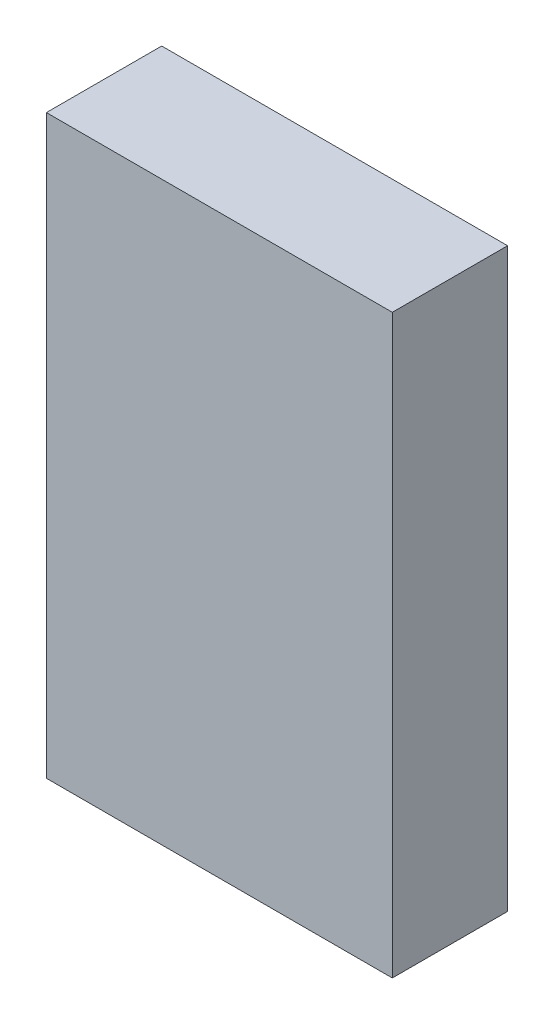
ISO-10303-21;
HEADER;
FILE_DESCRIPTION(('STEP AP214'),'2;1');
FILE_NAME('part.step','',(''),(''),'','','');
FILE_SCHEMA(('AUTOMOTIVE_DESIGN { 1 0 10303 214 1 1 1 1 }'));
ENDSEC;
DATA;
#1=APPLICATION_CONTEXT('core data for automotive mechanical design processes');
#2=APPLICATION_PROTOCOL_DEFINITION('international standard','automotive_design',2000,#1);
#3=PRODUCT_CONTEXT('',#1,'mechanical');
#4=PRODUCT('Part','Part','',(#3));
#5=PRODUCT_RELATED_PRODUCT_CATEGORY('part','',(#4));
#6=PRODUCT_DEFINITION_FORMATION('','',#4);
#7=PRODUCT_DEFINITION_CONTEXT('part definition',#1,'design');
#8=PRODUCT_DEFINITION('design','',#6,#7);
#9=PRODUCT_DEFINITION_SHAPE('','',#8);
#10=(LENGTH_UNIT() NAMED_UNIT(*) SI_UNIT(.MILLI.,.METRE.));
#11=(NAMED_UNIT(*) PLANE_ANGLE_UNIT() SI_UNIT($,.RADIAN.));
#12=(NAMED_UNIT(*) SI_UNIT($,.STERADIAN.) SOLID_ANGLE_UNIT());
#13=UNCERTAINTY_MEASURE_WITH_UNIT(LENGTH_MEASURE(1.E-05),#10,'distance_accuracy_value','');
#14=(GEOMETRIC_REPRESENTATION_CONTEXT(3) GLOBAL_UNCERTAINTY_ASSIGNED_CONTEXT((#13)) GLOBAL_UNIT_ASSIGNED_CONTEXT((#10,
#11,#12)) REPRESENTATION_CONTEXT('',''));
#15=CARTESIAN_POINT('',(0.,0.,0.));
#16=DIRECTION('',(0.,0.,1.));
#17=DIRECTION('',(1.,0.,0.));
#18=AXIS2_PLACEMENT_3D('',#15,#16,#17);
#19=CARTESIAN_POINT('',(-1.5,2.5,0.));
#20=DIRECTION('',(0.,1.,0.));
#21=DIRECTION('',(1.,0.,0.));
#22=AXIS2_PLACEMENT_3D('',#19,#20,#21);
#23=PLANE('',#22);
#24=DIRECTION('',(0.,0.,1.));
#25=VECTOR('',#24,1.);
#26=CARTESIAN_POINT('',(-1.5,2.5,0.));
#27=LINE('',#26,#25);
#28=CARTESIAN_POINT('',(-1.5,2.5,0.));
#29=VERTEX_POINT('',#28);
#30=CARTESIAN_POINT('',(-1.5,2.5,1.));
#31=VERTEX_POINT('',#30);
#32=EDGE_CURVE('E11',#29,#31,#27,.T.);
#33=ORIENTED_EDGE('',*,*,#32,.T.);
#34=DIRECTION('',(1.,0.,0.));
#35=VECTOR('',#34,1.);
#36=CARTESIAN_POINT('',(-1.5,2.5,1.));
#37=LINE('',#36,#35);
#38=CARTESIAN_POINT('',(1.5,2.5,1.));
#39=VERTEX_POINT('',#38);
#40=EDGE_CURVE('E24',#31,#39,#37,.T.);
#41=ORIENTED_EDGE('',*,*,#40,.T.);
#42=DIRECTION('',(0.,0.,1.));
#43=VECTOR('',#42,1.);
#44=CARTESIAN_POINT('',(1.5,2.5,0.));
#45=LINE('',#44,#43);
#46=CARTESIAN_POINT('',(1.5,2.5,0.));
#47=VERTEX_POINT('',#46);
#48=EDGE_CURVE('E85',#47,#39,#45,.T.);
#49=ORIENTED_EDGE('',*,*,#48,.F.);
#50=DIRECTION('',(1.,0.,0.));
#51=VECTOR('',#50,1.);
#52=CARTESIAN_POINT('',(-1.5,2.5,0.));
#53=LINE('',#52,#51);
#54=EDGE_CURVE('E83',#29,#47,#53,.T.);
#55=ORIENTED_EDGE('',*,*,#54,.F.);
#56=EDGE_LOOP('',(#33,#41,#49,#55));
#57=FACE_BOUND('',#56,.T.);
#58=ADVANCED_FACE('F17',(#57),#23,.T.);
#59=CARTESIAN_POINT('',(1.5,2.5,0.));
#60=DIRECTION('',(1.,0.,0.));
#61=DIRECTION('',(0.,-1.,0.));
#62=AXIS2_PLACEMENT_3D('',#59,#60,#61);
#63=PLANE('',#62);
#64=ORIENTED_EDGE('',*,*,#48,.T.);
#65=DIRECTION('',(0.,-1.,0.));
#66=VECTOR('',#65,1.);
#67=CARTESIAN_POINT('',(1.5,2.5,1.));
#68=LINE('',#67,#66);
#69=CARTESIAN_POINT('',(1.5,-2.5,1.));
#70=VERTEX_POINT('',#69);
#71=EDGE_CURVE('E81',#39,#70,#68,.T.);
#72=ORIENTED_EDGE('',*,*,#71,.T.);
#73=DIRECTION('',(0.,0.,1.));
#74=VECTOR('',#73,1.);
#75=CARTESIAN_POINT('',(1.5,-2.5,0.));
#76=LINE('',#75,#74);
#77=CARTESIAN_POINT('',(1.5,-2.5,0.));
#78=VERTEX_POINT('',#77);
#79=EDGE_CURVE('E79',#78,#70,#76,.T.);
#80=ORIENTED_EDGE('',*,*,#79,.F.);
#81=DIRECTION('',(0.,-1.,0.));
#82=VECTOR('',#81,1.);
#83=CARTESIAN_POINT('',(1.5,2.5,0.));
#84=LINE('',#83,#82);
#85=EDGE_CURVE('E70',#47,#78,#84,.T.);
#86=ORIENTED_EDGE('',*,*,#85,.F.);
#87=EDGE_LOOP('',(#64,#72,#80,#86));
#88=FACE_BOUND('',#87,.T.);
#89=ADVANCED_FACE('F90',(#88),#63,.T.);
#90=CARTESIAN_POINT('',(1.5,-2.5,0.));
#91=DIRECTION('',(0.,-1.,0.));
#92=DIRECTION('',(-1.,0.,0.));
#93=AXIS2_PLACEMENT_3D('',#90,#91,#92);
#94=PLANE('',#93);
#95=ORIENTED_EDGE('',*,*,#79,.T.);
#96=DIRECTION('',(-1.,0.,0.));
#97=VECTOR('',#96,1.);
#98=CARTESIAN_POINT('',(1.5,-2.5,1.));
#99=LINE('',#98,#97);
#100=CARTESIAN_POINT('',(-1.5,-2.5,1.));
#101=VERTEX_POINT('',#100);
#102=EDGE_CURVE('E60',#70,#101,#99,.T.);
#103=ORIENTED_EDGE('',*,*,#102,.T.);
#104=DIRECTION('',(0.,0.,1.));
#105=VECTOR('',#104,1.);
#106=CARTESIAN_POINT('',(-1.5,-2.5,0.));
#107=LINE('',#106,#105);
#108=CARTESIAN_POINT('',(-1.5,-2.5,0.));
#109=VERTEX_POINT('',#108);
#110=EDGE_CURVE('E54',#109,#101,#107,.T.);
#111=ORIENTED_EDGE('',*,*,#110,.F.);
#112=DIRECTION('',(-1.,0.,0.));
#113=VECTOR('',#112,1.);
#114=CARTESIAN_POINT('',(1.5,-2.5,0.));
#115=LINE('',#114,#113);
#116=EDGE_CURVE('E58',#78,#109,#115,.T.);
#117=ORIENTED_EDGE('',*,*,#116,.F.);
#118=EDGE_LOOP('',(#95,#103,#111,#117));
#119=FACE_BOUND('',#118,.T.);
#120=ADVANCED_FACE('F57',(#119),#94,.T.);
#121=CARTESIAN_POINT('',(-1.5,-2.5,0.));
#122=DIRECTION('',(-1.,0.,0.));
#123=DIRECTION('',(0.,1.,0.));
#124=AXIS2_PLACEMENT_3D('',#121,#122,#123);
#125=PLANE('',#124);
#126=ORIENTED_EDGE('',*,*,#110,.T.);
#127=DIRECTION('',(0.,1.,0.));
#128=VECTOR('',#127,1.);
#129=CARTESIAN_POINT('',(-1.5,-2.5,1.));
#130=LINE('',#129,#128);
#131=EDGE_CURVE('E71',#101,#31,#130,.T.);
#132=ORIENTED_EDGE('',*,*,#131,.T.);
#133=ORIENTED_EDGE('',*,*,#32,.F.);
#134=DIRECTION('',(0.,1.,0.));
#135=VECTOR('',#134,1.);
#136=CARTESIAN_POINT('',(-1.5,-2.5,0.));
#137=LINE('',#136,#135);
#138=EDGE_CURVE('E68',#109,#29,#137,.T.);
#139=ORIENTED_EDGE('',*,*,#138,.F.);
#140=EDGE_LOOP('',(#126,#132,#133,#139));
#141=FACE_BOUND('',#140,.T.);
#142=ADVANCED_FACE('F73',(#141),#125,.T.);
#143=CARTESIAN_POINT('',(0.,0.,0.));
#144=DIRECTION('',(0.,0.,-1.));
#145=DIRECTION('',(-1.,0.,0.));
#146=AXIS2_PLACEMENT_3D('',#143,#144,#145);
#147=PLANE('',#146);
#148=ORIENTED_EDGE('',*,*,#54,.T.);
#149=ORIENTED_EDGE('',*,*,#85,.T.);
#150=ORIENTED_EDGE('',*,*,#116,.T.);
#151=ORIENTED_EDGE('',*,*,#138,.T.);
#152=EDGE_LOOP('',(#148,#149,#150,#151));
#153=FACE_BOUND('',#152,.T.);
#154=ADVANCED_FACE('F67',(#153),#147,.T.);
#155=CARTESIAN_POINT('',(0.,0.,1.));
#156=DIRECTION('',(0.,0.,-1.));
#157=DIRECTION('',(-1.,0.,0.));
#158=AXIS2_PLACEMENT_3D('',#155,#156,#157);
#159=PLANE('',#158);
#160=ORIENTED_EDGE('',*,*,#131,.F.);
#161=ORIENTED_EDGE('',*,*,#102,.F.);
#162=ORIENTED_EDGE('',*,*,#71,.F.);
#163=ORIENTED_EDGE('',*,*,#40,.F.);
#164=EDGE_LOOP('',(#160,#161,#162,#163));
#165=FACE_BOUND('',#164,.T.);
#166=ADVANCED_FACE('F91',(#165),#159,.F.);
#167=CLOSED_SHELL('',(#58,#89,#120,#142,#154,#166));
#168=MANIFOLD_SOLID_BREP('B1',#167);
#169=ADVANCED_BREP_SHAPE_REPRESENTATION('',(#18,#168),#14);
#170=SHAPE_DEFINITION_REPRESENTATION(#9,#169);
ENDSEC;
END-ISO-10303-21;
